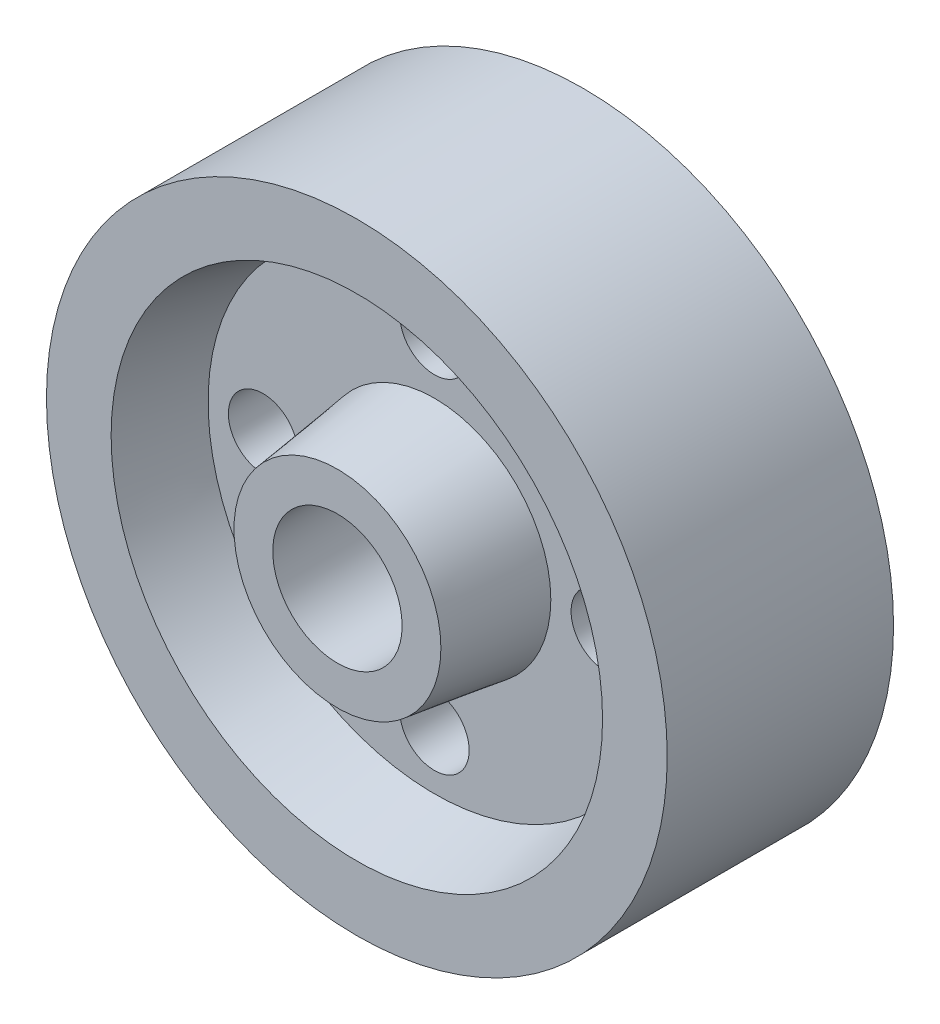
ISO-10303-21;
HEADER;
FILE_DESCRIPTION(('STEP AP214'),'2;1');
FILE_NAME('part.step','',(''),(''),'','','');
FILE_SCHEMA(('AUTOMOTIVE_DESIGN { 1 0 10303 214 1 1 1 1 }'));
ENDSEC;
DATA;
#1=APPLICATION_CONTEXT('core data for automotive mechanical design processes');
#2=APPLICATION_PROTOCOL_DEFINITION('international standard','automotive_design',2000,#1);
#3=PRODUCT_CONTEXT('',#1,'mechanical');
#4=PRODUCT('Part','Part','',(#3));
#5=PRODUCT_RELATED_PRODUCT_CATEGORY('part','',(#4));
#6=PRODUCT_DEFINITION_FORMATION('','',#4);
#7=PRODUCT_DEFINITION_CONTEXT('part definition',#1,'design');
#8=PRODUCT_DEFINITION('design','',#6,#7);
#9=PRODUCT_DEFINITION_SHAPE('','',#8);
#10=(LENGTH_UNIT() NAMED_UNIT(*) SI_UNIT(.MILLI.,.METRE.));
#11=(NAMED_UNIT(*) PLANE_ANGLE_UNIT() SI_UNIT($,.RADIAN.));
#12=(NAMED_UNIT(*) SI_UNIT($,.STERADIAN.) SOLID_ANGLE_UNIT());
#13=UNCERTAINTY_MEASURE_WITH_UNIT(LENGTH_MEASURE(1.E-05),#10,'distance_accuracy_value','');
#14=(GEOMETRIC_REPRESENTATION_CONTEXT(3) GLOBAL_UNCERTAINTY_ASSIGNED_CONTEXT((#13)) GLOBAL_UNIT_ASSIGNED_CONTEXT((#10,
#11,#12)) REPRESENTATION_CONTEXT('',''));
#15=CARTESIAN_POINT('',(0.,0.,0.));
#16=DIRECTION('',(0.,0.,1.));
#17=DIRECTION('',(1.,0.,0.));
#18=AXIS2_PLACEMENT_3D('',#15,#16,#17);
#19=CARTESIAN_POINT('',(0.,16.,0.));
#20=DIRECTION('',(0.,0.,-1.));
#21=DIRECTION('',(-1.,0.,0.));
#22=AXIS2_PLACEMENT_3D('',#19,#20,#21);
#23=PLANE('',#22);
#24=CARTESIAN_POINT('',(0.,0.,0.));
#25=DIRECTION('',(0.,0.,1.));
#26=DIRECTION('',(1.,0.,0.));
#27=AXIS2_PLACEMENT_3D('',#24,#25,#26);
#28=CIRCLE('',#27,10.);
#29=CARTESIAN_POINT('',(10.,0.,0.));
#30=VERTEX_POINT('',#29);
#31=EDGE_CURVE('E71',#30,#30,#28,.T.);
#32=ORIENTED_EDGE('',*,*,#31,.F.);
#33=EDGE_LOOP('',(#32));
#34=FACE_BOUND('',#33,.T.);
#35=CARTESIAN_POINT('',(0.,0.,0.));
#36=DIRECTION('',(0.,0.,1.));
#37=DIRECTION('',(1.,0.,0.));
#38=AXIS2_PLACEMENT_3D('',#35,#36,#37);
#39=CIRCLE('',#38,16.);
#40=CARTESIAN_POINT('',(16.,0.,0.));
#41=VERTEX_POINT('',#40);
#42=EDGE_CURVE('E65',#41,#41,#39,.T.);
#43=ORIENTED_EDGE('',*,*,#42,.T.);
#44=EDGE_LOOP('',(#43));
#45=FACE_BOUND('',#44,.T.);
#46=ADVANCED_FACE('F31',(#34,#45),#23,.F.);
#47=CARTESIAN_POINT('',(0.,0.,-41.));
#48=DIRECTION('',(0.,0.,1.));
#49=DIRECTION('',(1.,0.,0.));
#50=AXIS2_PLACEMENT_3D('',#47,#48,#49);
#51=PLANE('',#50);
#52=CARTESIAN_POINT('',(0.,0.,-41.));
#53=DIRECTION('',(0.,0.,1.));
#54=DIRECTION('',(1.,0.,0.));
#55=AXIS2_PLACEMENT_3D('',#52,#53,#54);
#56=CIRCLE('',#55,10.);
#57=CARTESIAN_POINT('',(10.,0.,-41.));
#58=VERTEX_POINT('',#57);
#59=EDGE_CURVE('E68',#58,#58,#56,.F.);
#60=ORIENTED_EDGE('',*,*,#59,.F.);
#61=EDGE_LOOP('',(#60));
#62=FACE_BOUND('',#61,.T.);
#63=CARTESIAN_POINT('',(0.,0.,-41.));
#64=DIRECTION('',(0.,0.,1.));
#65=DIRECTION('',(1.,0.,0.));
#66=AXIS2_PLACEMENT_3D('',#63,#64,#65);
#67=CIRCLE('',#66,16.);
#68=CARTESIAN_POINT('',(16.,0.,-41.));
#69=VERTEX_POINT('',#68);
#70=EDGE_CURVE('E10',#69,#69,#67,.T.);
#71=ORIENTED_EDGE('',*,*,#70,.F.);
#72=EDGE_LOOP('',(#71));
#73=FACE_BOUND('',#72,.T.);
#74=ADVANCED_FACE('F155',(#62,#73),#51,.F.);
#75=CARTESIAN_POINT('',(0.,0.,-41.));
#76=DIRECTION('',(0.,0.,1.));
#77=DIRECTION('',(1.,0.,0.));
#78=AXIS2_PLACEMENT_3D('',#75,#76,#77);
#79=CONICAL_SURFACE('',#78,16.,0.132551532296674);
#80=CARTESIAN_POINT('',(0.,0.,-26.));
#81=DIRECTION('',(0.,0.,1.));
#82=DIRECTION('',(1.,0.,0.));
#83=AXIS2_PLACEMENT_3D('',#80,#81,#82);
#84=CIRCLE('',#83,18.);
#85=CARTESIAN_POINT('',(18.,0.,-26.));
#86=VERTEX_POINT('',#85);
#87=EDGE_CURVE('E37',#86,#86,#84,.T.);
#88=ORIENTED_EDGE('',*,*,#87,.F.);
#89=EDGE_LOOP('',(#88));
#90=FACE_BOUND('',#89,.T.);
#91=ORIENTED_EDGE('',*,*,#70,.T.);
#92=EDGE_LOOP('',(#91));
#93=FACE_BOUND('',#92,.T.);
#94=ADVANCED_FACE('F149',(#90,#93),#79,.T.);
#95=CARTESIAN_POINT('',(0.,18.,-26.));
#96=DIRECTION('',(0.,0.,1.));
#97=DIRECTION('',(1.,0.,0.));
#98=AXIS2_PLACEMENT_3D('',#95,#96,#97);
#99=PLANE('',#98);
#100=CARTESIAN_POINT('',(26.5,0.,-26.));
#101=DIRECTION('',(0.,0.,1.));
#102=DIRECTION('',(1.,0.,0.));
#103=AXIS2_PLACEMENT_3D('',#100,#101,#102);
#104=CIRCLE('',#103,5.36888933608148);
#105=CARTESIAN_POINT('',(31.8688893360815,0.,-26.));
#106=VERTEX_POINT('',#105);
#107=EDGE_CURVE('E80',#106,#106,#104,.F.);
#108=ORIENTED_EDGE('',*,*,#107,.F.);
#109=EDGE_LOOP('',(#108));
#110=FACE_BOUND('',#109,.T.);
#111=CARTESIAN_POINT('',(0.,-26.5,-26.));
#112=DIRECTION('',(0.,0.,1.));
#113=DIRECTION('',(1.,0.,0.));
#114=AXIS2_PLACEMENT_3D('',#111,#112,#113);
#115=CIRCLE('',#114,5.36888933608149);
#116=CARTESIAN_POINT('',(5.36888933608149,-26.5,-26.));
#117=VERTEX_POINT('',#116);
#118=EDGE_CURVE('E88',#117,#117,#115,.F.);
#119=ORIENTED_EDGE('',*,*,#118,.F.);
#120=EDGE_LOOP('',(#119));
#121=FACE_BOUND('',#120,.T.);
#122=CARTESIAN_POINT('',(-26.5,0.,-26.));
#123=DIRECTION('',(0.,0.,1.));
#124=DIRECTION('',(1.,0.,0.));
#125=AXIS2_PLACEMENT_3D('',#122,#123,#124);
#126=CIRCLE('',#125,5.36888933608149);
#127=CARTESIAN_POINT('',(-21.1311106639185,0.,-26.));
#128=VERTEX_POINT('',#127);
#129=EDGE_CURVE('E81',#128,#128,#126,.F.);
#130=ORIENTED_EDGE('',*,*,#129,.F.);
#131=EDGE_LOOP('',(#130));
#132=FACE_BOUND('',#131,.T.);
#133=CARTESIAN_POINT('',(0.,26.5,-26.));
#134=DIRECTION('',(0.,0.,1.));
#135=DIRECTION('',(1.,0.,0.));
#136=AXIS2_PLACEMENT_3D('',#133,#134,#135);
#137=CIRCLE('',#136,5.36888933608149);
#138=CARTESIAN_POINT('',(5.36888933608149,26.5,-26.));
#139=VERTEX_POINT('',#138);
#140=EDGE_CURVE('E74',#139,#139,#137,.F.);
#141=ORIENTED_EDGE('',*,*,#140,.F.);
#142=EDGE_LOOP('',(#141));
#143=FACE_BOUND('',#142,.T.);
#144=CARTESIAN_POINT('',(0.,0.,-26.));
#145=DIRECTION('',(0.,0.,1.));
#146=DIRECTION('',(1.,0.,0.));
#147=AXIS2_PLACEMENT_3D('',#144,#145,#146);
#148=CIRCLE('',#147,35.);
#149=CARTESIAN_POINT('',(35.,0.,-26.));
#150=VERTEX_POINT('',#149);
#151=EDGE_CURVE('E41',#150,#150,#148,.T.);
#152=ORIENTED_EDGE('',*,*,#151,.F.);
#153=EDGE_LOOP('',(#152));
#154=FACE_BOUND('',#153,.T.);
#155=ORIENTED_EDGE('',*,*,#87,.T.);
#156=EDGE_LOOP('',(#155));
#157=FACE_BOUND('',#156,.T.);
#158=ADVANCED_FACE('F144',(#110,#121,#132,#143,#154,#157),#99,.F.);
#159=CARTESIAN_POINT('',(0.,0.,-26.));
#160=DIRECTION('',(0.,0.,-1.));
#161=DIRECTION('',(-1.,0.,0.));
#162=AXIS2_PLACEMENT_3D('',#159,#160,#161);
#163=CONICAL_SURFACE('',#162,35.,0.244978663126864);
#164=CARTESIAN_POINT('',(0.,0.,-38.));
#165=DIRECTION('',(0.,0.,1.));
#166=DIRECTION('',(1.,0.,0.));
#167=AXIS2_PLACEMENT_3D('',#164,#165,#166);
#168=CIRCLE('',#167,38.);
#169=CARTESIAN_POINT('',(38.,0.,-38.));
#170=VERTEX_POINT('',#169);
#171=EDGE_CURVE('E45',#170,#170,#168,.T.);
#172=ORIENTED_EDGE('',*,*,#171,.F.);
#173=EDGE_LOOP('',(#172));
#174=FACE_BOUND('',#173,.T.);
#175=ORIENTED_EDGE('',*,*,#151,.T.);
#176=EDGE_LOOP('',(#175));
#177=FACE_BOUND('',#176,.T.);
#178=ADVANCED_FACE('F138',(#174,#177),#163,.F.);
#179=CARTESIAN_POINT('',(0.,38.,-38.));
#180=DIRECTION('',(0.,0.,1.));
#181=DIRECTION('',(1.,0.,0.));
#182=AXIS2_PLACEMENT_3D('',#179,#180,#181);
#183=PLANE('',#182);
#184=CARTESIAN_POINT('',(0.,0.,-38.));
#185=DIRECTION('',(0.,0.,1.));
#186=DIRECTION('',(1.,0.,0.));
#187=AXIS2_PLACEMENT_3D('',#184,#185,#186);
#188=CIRCLE('',#187,48.);
#189=CARTESIAN_POINT('',(48.,0.,-38.));
#190=VERTEX_POINT('',#189);
#191=EDGE_CURVE('E50',#190,#190,#188,.T.);
#192=ORIENTED_EDGE('',*,*,#191,.F.);
#193=EDGE_LOOP('',(#192));
#194=FACE_BOUND('',#193,.T.);
#195=ORIENTED_EDGE('',*,*,#171,.T.);
#196=EDGE_LOOP('',(#195));
#197=FACE_BOUND('',#196,.T.);
#198=ADVANCED_FACE('F132',(#194,#197),#183,.F.);
#199=CARTESIAN_POINT('',(0.,0.,0.));
#200=DIRECTION('',(0.,0.,1.));
#201=DIRECTION('',(1.,0.,0.));
#202=AXIS2_PLACEMENT_3D('',#199,#200,#201);
#203=CYLINDRICAL_SURFACE('',#202,48.);
#204=CARTESIAN_POINT('',(0.,0.,-3.));
#205=DIRECTION('',(0.,0.,1.));
#206=DIRECTION('',(1.,0.,0.));
#207=AXIS2_PLACEMENT_3D('',#204,#205,#206);
#208=CIRCLE('',#207,48.);
#209=CARTESIAN_POINT('',(48.,0.,-3.));
#210=VERTEX_POINT('',#209);
#211=EDGE_CURVE('E53',#210,#210,#208,.T.);
#212=ORIENTED_EDGE('',*,*,#211,.F.);
#213=EDGE_LOOP('',(#212));
#214=FACE_BOUND('',#213,.T.);
#215=ORIENTED_EDGE('',*,*,#191,.T.);
#216=EDGE_LOOP('',(#215));
#217=FACE_BOUND('',#216,.T.);
#218=ADVANCED_FACE('F126',(#214,#217),#203,.T.);
#219=CARTESIAN_POINT('',(0.,48.,-3.));
#220=DIRECTION('',(0.,0.,-1.));
#221=DIRECTION('',(-1.,0.,0.));
#222=AXIS2_PLACEMENT_3D('',#219,#220,#221);
#223=PLANE('',#222);
#224=CARTESIAN_POINT('',(0.,0.,-3.));
#225=DIRECTION('',(0.,0.,1.));
#226=DIRECTION('',(1.,0.,0.));
#227=AXIS2_PLACEMENT_3D('',#224,#225,#226);
#228=CIRCLE('',#227,38.);
#229=CARTESIAN_POINT('',(38.,0.,-3.));
#230=VERTEX_POINT('',#229);
#231=EDGE_CURVE('E56',#230,#230,#228,.T.);
#232=ORIENTED_EDGE('',*,*,#231,.F.);
#233=EDGE_LOOP('',(#232));
#234=FACE_BOUND('',#233,.T.);
#235=ORIENTED_EDGE('',*,*,#211,.T.);
#236=EDGE_LOOP('',(#235));
#237=FACE_BOUND('',#236,.T.);
#238=ADVANCED_FACE('F120',(#234,#237),#223,.F.);
#239=CARTESIAN_POINT('',(0.,0.,-3.));
#240=DIRECTION('',(0.,0.,1.));
#241=DIRECTION('',(1.,0.,0.));
#242=AXIS2_PLACEMENT_3D('',#239,#240,#241);
#243=CONICAL_SURFACE('',#242,38.,0.244978663126864);
#244=CARTESIAN_POINT('',(0.,0.,-15.));
#245=DIRECTION('',(0.,0.,1.));
#246=DIRECTION('',(1.,0.,0.));
#247=AXIS2_PLACEMENT_3D('',#244,#245,#246);
#248=CIRCLE('',#247,35.);
#249=CARTESIAN_POINT('',(35.,0.,-15.));
#250=VERTEX_POINT('',#249);
#251=EDGE_CURVE('E59',#250,#250,#248,.T.);
#252=ORIENTED_EDGE('',*,*,#251,.F.);
#253=EDGE_LOOP('',(#252));
#254=FACE_BOUND('',#253,.T.);
#255=ORIENTED_EDGE('',*,*,#231,.T.);
#256=EDGE_LOOP('',(#255));
#257=FACE_BOUND('',#256,.T.);
#258=ADVANCED_FACE('F106',(#254,#257),#243,.F.);
#259=CARTESIAN_POINT('',(0.,35.,-15.));
#260=DIRECTION('',(0.,0.,-1.));
#261=DIRECTION('',(-1.,0.,0.));
#262=AXIS2_PLACEMENT_3D('',#259,#260,#261);
#263=PLANE('',#262);
#264=CARTESIAN_POINT('',(26.5,0.,-15.));
#265=DIRECTION('',(0.,0.,1.));
#266=DIRECTION('',(1.,0.,0.));
#267=AXIS2_PLACEMENT_3D('',#264,#265,#266);
#268=CIRCLE('',#267,5.36888933608148);
#269=CARTESIAN_POINT('',(31.8688893360815,0.,-15.));
#270=VERTEX_POINT('',#269);
#271=EDGE_CURVE('E91',#270,#270,#268,.T.);
#272=ORIENTED_EDGE('',*,*,#271,.F.);
#273=EDGE_LOOP('',(#272));
#274=FACE_BOUND('',#273,.T.);
#275=CARTESIAN_POINT('',(0.,-26.5,-15.));
#276=DIRECTION('',(0.,0.,1.));
#277=DIRECTION('',(1.,0.,0.));
#278=AXIS2_PLACEMENT_3D('',#275,#276,#277);
#279=CIRCLE('',#278,5.36888933608149);
#280=CARTESIAN_POINT('',(5.36888933608149,-26.5,-15.));
#281=VERTEX_POINT('',#280);
#282=EDGE_CURVE('E84',#281,#281,#279,.T.);
#283=ORIENTED_EDGE('',*,*,#282,.F.);
#284=EDGE_LOOP('',(#283));
#285=FACE_BOUND('',#284,.T.);
#286=CARTESIAN_POINT('',(-26.5,0.,-15.));
#287=DIRECTION('',(0.,0.,1.));
#288=DIRECTION('',(1.,0.,0.));
#289=AXIS2_PLACEMENT_3D('',#286,#287,#288);
#290=CIRCLE('',#289,5.36888933608149);
#291=CARTESIAN_POINT('',(-21.1311106639185,0.,-15.));
#292=VERTEX_POINT('',#291);
#293=EDGE_CURVE('E85',#292,#292,#290,.T.);
#294=ORIENTED_EDGE('',*,*,#293,.F.);
#295=EDGE_LOOP('',(#294));
#296=FACE_BOUND('',#295,.T.);
#297=CARTESIAN_POINT('',(0.,26.5,-15.));
#298=DIRECTION('',(0.,0.,1.));
#299=DIRECTION('',(1.,0.,0.));
#300=AXIS2_PLACEMENT_3D('',#297,#298,#299);
#301=CIRCLE('',#300,5.36888933608149);
#302=CARTESIAN_POINT('',(5.36888933608149,26.5,-15.));
#303=VERTEX_POINT('',#302);
#304=EDGE_CURVE('E77',#303,#303,#301,.T.);
#305=ORIENTED_EDGE('',*,*,#304,.F.);
#306=EDGE_LOOP('',(#305));
#307=FACE_BOUND('',#306,.T.);
#308=CARTESIAN_POINT('',(0.,0.,-15.));
#309=DIRECTION('',(0.,0.,1.));
#310=DIRECTION('',(1.,0.,0.));
#311=AXIS2_PLACEMENT_3D('',#308,#309,#310);
#312=CIRCLE('',#311,18.);
#313=CARTESIAN_POINT('',(18.,0.,-15.));
#314=VERTEX_POINT('',#313);
#315=EDGE_CURVE('E62',#314,#314,#312,.T.);
#316=ORIENTED_EDGE('',*,*,#315,.F.);
#317=EDGE_LOOP('',(#316));
#318=FACE_BOUND('',#317,.T.);
#319=ORIENTED_EDGE('',*,*,#251,.T.);
#320=EDGE_LOOP('',(#319));
#321=FACE_BOUND('',#320,.T.);
#322=ADVANCED_FACE('F102',(#274,#285,#296,#307,#318,#321),#263,.F.);
#323=CARTESIAN_POINT('',(0.,0.,-15.));
#324=DIRECTION('',(0.,0.,-1.));
#325=DIRECTION('',(-1.,0.,0.));
#326=AXIS2_PLACEMENT_3D('',#323,#324,#325);
#327=CONICAL_SURFACE('',#326,18.,0.132551532296674);
#328=ORIENTED_EDGE('',*,*,#42,.F.);
#329=EDGE_LOOP('',(#328));
#330=FACE_BOUND('',#329,.T.);
#331=ORIENTED_EDGE('',*,*,#315,.T.);
#332=EDGE_LOOP('',(#331));
#333=FACE_BOUND('',#332,.T.);
#334=ADVANCED_FACE('F105',(#330,#333),#327,.T.);
#335=CARTESIAN_POINT('',(0.,0.,-41.001));
#336=DIRECTION('',(0.,0.,1.));
#337=DIRECTION('',(1.,0.,0.));
#338=AXIS2_PLACEMENT_3D('',#335,#336,#337);
#339=CYLINDRICAL_SURFACE('',#338,10.);
#340=ORIENTED_EDGE('',*,*,#31,.T.);
#341=EDGE_LOOP('',(#340));
#342=FACE_BOUND('',#341,.T.);
#343=ORIENTED_EDGE('',*,*,#59,.T.);
#344=EDGE_LOOP('',(#343));
#345=FACE_BOUND('',#344,.T.);
#346=ADVANCED_FACE('F172',(#342,#345),#339,.F.);
#347=CARTESIAN_POINT('',(0.,26.5,-41.001));
#348=DIRECTION('',(0.,0.,1.));
#349=DIRECTION('',(1.,0.,0.));
#350=AXIS2_PLACEMENT_3D('',#347,#348,#349);
#351=CYLINDRICAL_SURFACE('',#350,5.36888933608149);
#352=ORIENTED_EDGE('',*,*,#304,.T.);
#353=EDGE_LOOP('',(#352));
#354=FACE_BOUND('',#353,.T.);
#355=ORIENTED_EDGE('',*,*,#140,.T.);
#356=EDGE_LOOP('',(#355));
#357=FACE_BOUND('',#356,.T.);
#358=ADVANCED_FACE('F177',(#354,#357),#351,.F.);
#359=CARTESIAN_POINT('',(-26.5,0.,-41.001));
#360=DIRECTION('',(0.,0.,1.));
#361=DIRECTION('',(1.,0.,0.));
#362=AXIS2_PLACEMENT_3D('',#359,#360,#361);
#363=CYLINDRICAL_SURFACE('',#362,5.36888933608149);
#364=ORIENTED_EDGE('',*,*,#293,.T.);
#365=EDGE_LOOP('',(#364));
#366=FACE_BOUND('',#365,.T.);
#367=ORIENTED_EDGE('',*,*,#129,.T.);
#368=EDGE_LOOP('',(#367));
#369=FACE_BOUND('',#368,.T.);
#370=ADVANCED_FACE('F183',(#366,#369),#363,.F.);
#371=CARTESIAN_POINT('',(0.,-26.5,-41.001));
#372=DIRECTION('',(0.,0.,1.));
#373=DIRECTION('',(1.,0.,0.));
#374=AXIS2_PLACEMENT_3D('',#371,#372,#373);
#375=CYLINDRICAL_SURFACE('',#374,5.36888933608149);
#376=ORIENTED_EDGE('',*,*,#282,.T.);
#377=EDGE_LOOP('',(#376));
#378=FACE_BOUND('',#377,.T.);
#379=ORIENTED_EDGE('',*,*,#118,.T.);
#380=EDGE_LOOP('',(#379));
#381=FACE_BOUND('',#380,.T.);
#382=ADVANCED_FACE('F187',(#378,#381),#375,.F.);
#383=CARTESIAN_POINT('',(26.5,0.,-41.001));
#384=DIRECTION('',(0.,0.,1.));
#385=DIRECTION('',(1.,0.,0.));
#386=AXIS2_PLACEMENT_3D('',#383,#384,#385);
#387=CYLINDRICAL_SURFACE('',#386,5.36888933608148);
#388=ORIENTED_EDGE('',*,*,#271,.T.);
#389=EDGE_LOOP('',(#388));
#390=FACE_BOUND('',#389,.T.);
#391=ORIENTED_EDGE('',*,*,#107,.T.);
#392=EDGE_LOOP('',(#391));
#393=FACE_BOUND('',#392,.T.);
#394=ADVANCED_FACE('F99',(#390,#393),#387,.F.);
#395=CLOSED_SHELL('',(#46,#74,#94,#158,#178,#198,#218,#238,#258,#322,#334,#346,#358,#370,#382,#394));
#396=MANIFOLD_SOLID_BREP('B2',#395);
#397=ADVANCED_BREP_SHAPE_REPRESENTATION('',(#18,#396),#14);
#398=SHAPE_DEFINITION_REPRESENTATION(#9,#397);
ENDSEC;
END-ISO-10303-21;
